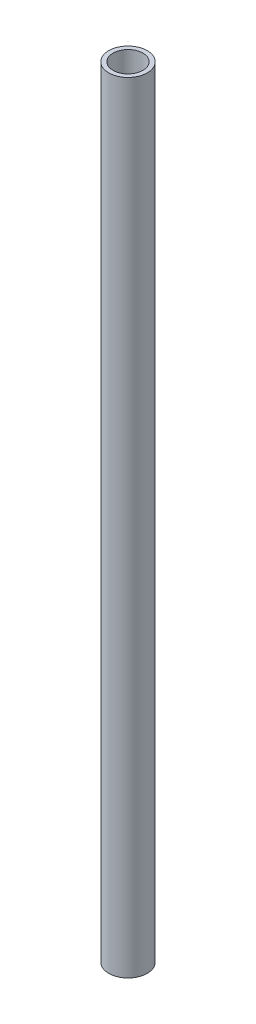
ISO-10303-21;
HEADER;
FILE_DESCRIPTION(('STEP AP214'),'2;1');
FILE_NAME('part.step','',(''),(''),'','','');
FILE_SCHEMA(('AUTOMOTIVE_DESIGN { 1 0 10303 214 1 1 1 1 }'));
ENDSEC;
DATA;
#1=APPLICATION_CONTEXT('core data for automotive mechanical design processes');
#2=APPLICATION_PROTOCOL_DEFINITION('international standard','automotive_design',2000,#1);
#3=PRODUCT_CONTEXT('',#1,'mechanical');
#4=PRODUCT('Part','Part','',(#3));
#5=PRODUCT_RELATED_PRODUCT_CATEGORY('part','',(#4));
#6=PRODUCT_DEFINITION_FORMATION('','',#4);
#7=PRODUCT_DEFINITION_CONTEXT('part definition',#1,'design');
#8=PRODUCT_DEFINITION('design','',#6,#7);
#9=PRODUCT_DEFINITION_SHAPE('','',#8);
#10=(LENGTH_UNIT() NAMED_UNIT(*) SI_UNIT(.MILLI.,.METRE.));
#11=(NAMED_UNIT(*) PLANE_ANGLE_UNIT() SI_UNIT($,.RADIAN.));
#12=(NAMED_UNIT(*) SI_UNIT($,.STERADIAN.) SOLID_ANGLE_UNIT());
#13=UNCERTAINTY_MEASURE_WITH_UNIT(LENGTH_MEASURE(1.E-05),#10,'distance_accuracy_value','');
#14=(GEOMETRIC_REPRESENTATION_CONTEXT(3) GLOBAL_UNCERTAINTY_ASSIGNED_CONTEXT((#13)) GLOBAL_UNIT_ASSIGNED_CONTEXT((#10,
#11,#12)) REPRESENTATION_CONTEXT('',''));
#15=CARTESIAN_POINT('',(0.,0.,0.));
#16=DIRECTION('',(0.,0.,1.));
#17=DIRECTION('',(1.,0.,0.));
#18=AXIS2_PLACEMENT_3D('',#15,#16,#17);
#19=CARTESIAN_POINT('',(0.,2307.62,0.));
#20=DIRECTION('',(0.,-1.,0.));
#21=DIRECTION('',(0.,0.,-1.));
#22=AXIS2_PLACEMENT_3D('',#19,#20,#21);
#23=CYLINDRICAL_SURFACE('',#22,57.);
#24=CARTESIAN_POINT('',(0.,2307.62,0.));
#25=DIRECTION('',(0.,1.,0.));
#26=DIRECTION('',(0.,0.,1.));
#27=AXIS2_PLACEMENT_3D('',#24,#25,#26);
#28=CIRCLE('',#27,57.);
#29=CARTESIAN_POINT('',(0.,2307.62,57.));
#30=VERTEX_POINT('',#29);
#31=EDGE_CURVE('E10',#30,#30,#28,.T.);
#32=ORIENTED_EDGE('',*,*,#31,.F.);
#33=EDGE_LOOP('',(#32));
#34=FACE_BOUND('',#33,.T.);
#35=CARTESIAN_POINT('',(0.,0.,0.));
#36=DIRECTION('',(0.,1.,0.));
#37=DIRECTION('',(0.,0.,1.));
#38=AXIS2_PLACEMENT_3D('',#35,#36,#37);
#39=CIRCLE('',#38,57.);
#40=CARTESIAN_POINT('',(0.,0.,57.));
#41=VERTEX_POINT('',#40);
#42=EDGE_CURVE('E38',#41,#41,#39,.T.);
#43=ORIENTED_EDGE('',*,*,#42,.T.);
#44=EDGE_LOOP('',(#43));
#45=FACE_BOUND('',#44,.T.);
#46=ADVANCED_FACE('F35',(#34,#45),#23,.T.);
#47=CARTESIAN_POINT('',(0.,2307.62,0.));
#48=DIRECTION('',(0.,1.,0.));
#49=DIRECTION('',(0.,0.,1.));
#50=AXIS2_PLACEMENT_3D('',#47,#48,#49);
#51=PLANE('',#50);
#52=CARTESIAN_POINT('',(0.,2307.62,0.));
#53=DIRECTION('',(0.,1.,0.));
#54=DIRECTION('',(0.,0.,1.));
#55=AXIS2_PLACEMENT_3D('',#52,#53,#54);
#56=CIRCLE('',#55,44.3);
#57=CARTESIAN_POINT('',(0.,2307.62,44.3));
#58=VERTEX_POINT('',#57);
#59=EDGE_CURVE('E45',#58,#58,#56,.T.);
#60=ORIENTED_EDGE('',*,*,#59,.F.);
#61=EDGE_LOOP('',(#60));
#62=FACE_BOUND('',#61,.T.);
#63=ORIENTED_EDGE('',*,*,#31,.T.);
#64=EDGE_LOOP('',(#63));
#65=FACE_BOUND('',#64,.T.);
#66=ADVANCED_FACE('F66',(#62,#65),#51,.T.);
#67=CARTESIAN_POINT('',(0.,0.,0.));
#68=DIRECTION('',(0.,1.,0.));
#69=DIRECTION('',(0.,0.,1.));
#70=AXIS2_PLACEMENT_3D('',#67,#68,#69);
#71=PLANE('',#70);
#72=ORIENTED_EDGE('',*,*,#42,.F.);
#73=EDGE_LOOP('',(#72));
#74=FACE_BOUND('',#73,.T.);
#75=ADVANCED_FACE('F57',(#74),#71,.F.);
#76=CARTESIAN_POINT('',(0.,2307.62,0.));
#77=DIRECTION('',(0.,-1.,0.));
#78=DIRECTION('',(0.,0.,-1.));
#79=AXIS2_PLACEMENT_3D('',#76,#77,#78);
#80=CYLINDRICAL_SURFACE('',#79,44.3);
#81=ORIENTED_EDGE('',*,*,#59,.T.);
#82=EDGE_LOOP('',(#81));
#83=FACE_BOUND('',#82,.T.);
#84=CARTESIAN_POINT('',(0.,12.7000000000002,0.));
#85=DIRECTION('',(0.,1.,0.));
#86=DIRECTION('',(0.,0.,1.));
#87=AXIS2_PLACEMENT_3D('',#84,#85,#86);
#88=CIRCLE('',#87,44.3);
#89=CARTESIAN_POINT('',(0.,12.7000000000002,44.3));
#90=VERTEX_POINT('',#89);
#91=EDGE_CURVE('E49',#90,#90,#88,.T.);
#92=ORIENTED_EDGE('',*,*,#91,.F.);
#93=EDGE_LOOP('',(#92));
#94=FACE_BOUND('',#93,.T.);
#95=ADVANCED_FACE('F55',(#83,#94),#80,.F.);
#96=CARTESIAN_POINT('',(0.,12.7,0.));
#97=DIRECTION('',(0.,1.,0.));
#98=DIRECTION('',(0.,0.,1.));
#99=AXIS2_PLACEMENT_3D('',#96,#97,#98);
#100=PLANE('',#99);
#101=ORIENTED_EDGE('',*,*,#91,.T.);
#102=EDGE_LOOP('',(#101));
#103=FACE_BOUND('',#102,.T.);
#104=ADVANCED_FACE('F53',(#103),#100,.T.);
#105=CLOSED_SHELL('',(#46,#66,#75,#95,#104));
#106=MANIFOLD_SOLID_BREP('B2',#105);
#107=ADVANCED_BREP_SHAPE_REPRESENTATION('',(#18,#106),#14);
#108=SHAPE_DEFINITION_REPRESENTATION(#9,#107);
ENDSEC;
END-ISO-10303-21;
